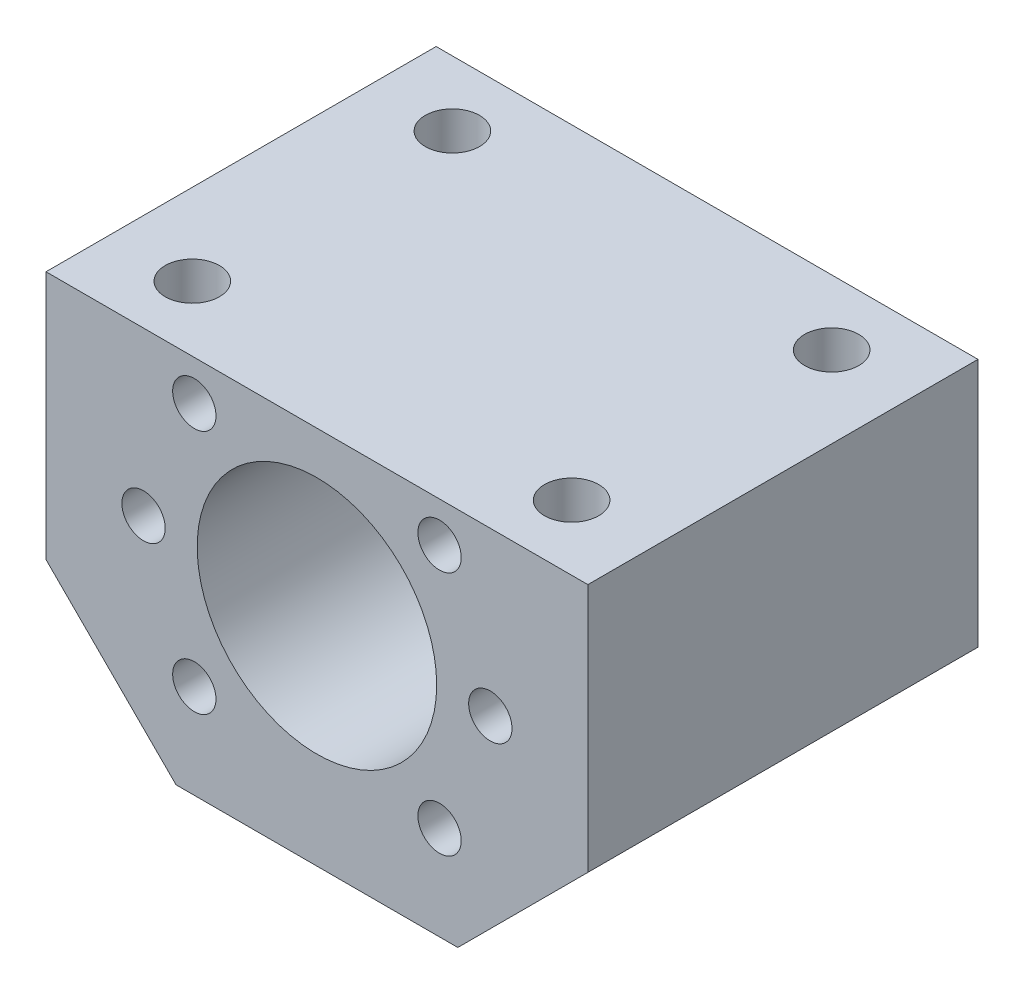
ISO-10303-21;
HEADER;
FILE_DESCRIPTION(('STEP AP214'),'2;1');
FILE_NAME('part.step','',(''),(''),'','','');
FILE_SCHEMA(('AUTOMOTIVE_DESIGN { 1 0 10303 214 1 1 1 1 }'));
ENDSEC;
DATA;
#1=APPLICATION_CONTEXT('core data for automotive mechanical design processes');
#2=APPLICATION_PROTOCOL_DEFINITION('international standard','automotive_design',2000,#1);
#3=PRODUCT_CONTEXT('',#1,'mechanical');
#4=PRODUCT('Part','Part','',(#3));
#5=PRODUCT_RELATED_PRODUCT_CATEGORY('part','',(#4));
#6=PRODUCT_DEFINITION_FORMATION('','',#4);
#7=PRODUCT_DEFINITION_CONTEXT('part definition',#1,'design');
#8=PRODUCT_DEFINITION('design','',#6,#7);
#9=PRODUCT_DEFINITION_SHAPE('','',#8);
#10=(LENGTH_UNIT() NAMED_UNIT(*) SI_UNIT(.MILLI.,.METRE.));
#11=(NAMED_UNIT(*) PLANE_ANGLE_UNIT() SI_UNIT($,.RADIAN.));
#12=(NAMED_UNIT(*) SI_UNIT($,.STERADIAN.) SOLID_ANGLE_UNIT());
#13=UNCERTAINTY_MEASURE_WITH_UNIT(LENGTH_MEASURE(1.E-05),#10,'distance_accuracy_value','');
#14=(GEOMETRIC_REPRESENTATION_CONTEXT(3) GLOBAL_UNCERTAINTY_ASSIGNED_CONTEXT((#13)) GLOBAL_UNIT_ASSIGNED_CONTEXT((#10,
#11,#12)) REPRESENTATION_CONTEXT('',''));
#15=CARTESIAN_POINT('',(0.,0.,0.));
#16=DIRECTION('',(0.,0.,1.));
#17=DIRECTION('',(1.,0.,0.));
#18=AXIS2_PLACEMENT_3D('',#15,#16,#17);
#19=CARTESIAN_POINT('',(0.,0.,36.));
#20=DIRECTION('',(0.,0.,1.));
#21=DIRECTION('',(1.,0.,0.));
#22=AXIS2_PLACEMENT_3D('',#19,#20,#21);
#23=PLANE('',#22);
#24=CARTESIAN_POINT('',(11.3137084989847,11.3137084989848,36.));
#25=DIRECTION('',(0.,0.,1.));
#26=DIRECTION('',(-1.,0.,0.));
#27=AXIS2_PLACEMENT_3D('',#24,#25,#26);
#28=CIRCLE('',#27,2.);
#29=CARTESIAN_POINT('',(9.31370849898474,11.3137084989848,36.));
#30=VERTEX_POINT('',#29);
#31=EDGE_CURVE('E292',#30,#30,#28,.T.);
#32=ORIENTED_EDGE('',*,*,#31,.F.);
#33=EDGE_LOOP('',(#32));
#34=FACE_BOUND('',#33,.T.);
#35=CARTESIAN_POINT('',(-11.3137084989847,-11.3137084989848,36.));
#36=DIRECTION('',(0.,0.,1.));
#37=DIRECTION('',(-1.,0.,0.));
#38=AXIS2_PLACEMENT_3D('',#35,#36,#37);
#39=CIRCLE('',#38,2.);
#40=CARTESIAN_POINT('',(-13.3137084989847,-11.3137084989848,36.));
#41=VERTEX_POINT('',#40);
#42=EDGE_CURVE('E308',#41,#41,#39,.T.);
#43=ORIENTED_EDGE('',*,*,#42,.F.);
#44=EDGE_LOOP('',(#43));
#45=FACE_BOUND('',#44,.T.);
#46=CARTESIAN_POINT('',(-16.,0.,36.));
#47=DIRECTION('',(0.,0.,1.));
#48=DIRECTION('',(1.,0.,0.));
#49=AXIS2_PLACEMENT_3D('',#46,#47,#48);
#50=CIRCLE('',#49,2.);
#51=CARTESIAN_POINT('',(-14.,0.,36.));
#52=VERTEX_POINT('',#51);
#53=EDGE_CURVE('E324',#52,#52,#50,.T.);
#54=ORIENTED_EDGE('',*,*,#53,.F.);
#55=EDGE_LOOP('',(#54));
#56=FACE_BOUND('',#55,.T.);
#57=DIRECTION('',(0.,-1.,0.));
#58=VECTOR('',#57,1.);
#59=CARTESIAN_POINT('',(-25.,15.,36.));
#60=LINE('',#59,#58);
#61=CARTESIAN_POINT('',(-25.,15.,36.));
#62=VERTEX_POINT('',#61);
#63=CARTESIAN_POINT('',(-25.,-8.00000000000001,36.));
#64=VERTEX_POINT('',#63);
#65=EDGE_CURVE('E148',#62,#64,#60,.T.);
#66=ORIENTED_EDGE('',*,*,#65,.T.);
#67=DIRECTION('',(0.707106781186548,-0.707106781186547,0.));
#68=VECTOR('',#67,1.);
#69=CARTESIAN_POINT('',(-25.,-8.00000000000001,36.));
#70=LINE('',#69,#68);
#71=CARTESIAN_POINT('',(-13.,-20.,36.));
#72=VERTEX_POINT('',#71);
#73=EDGE_CURVE('E95',#64,#72,#70,.T.);
#74=ORIENTED_EDGE('',*,*,#73,.T.);
#75=DIRECTION('',(1.,0.,0.));
#76=VECTOR('',#75,1.);
#77=CARTESIAN_POINT('',(-13.,-20.,36.));
#78=LINE('',#77,#76);
#79=CARTESIAN_POINT('',(13.,-20.,36.));
#80=VERTEX_POINT('',#79);
#81=EDGE_CURVE('E108',#72,#80,#78,.T.);
#82=ORIENTED_EDGE('',*,*,#81,.T.);
#83=DIRECTION('',(0.707106781186547,0.707106781186548,0.));
#84=VECTOR('',#83,1.);
#85=CARTESIAN_POINT('',(25.,-8.,36.));
#86=LINE('',#85,#84);
#87=CARTESIAN_POINT('',(25.,-8.,36.));
#88=VERTEX_POINT('',#87);
#89=EDGE_CURVE('E102',#80,#88,#86,.T.);
#90=ORIENTED_EDGE('',*,*,#89,.T.);
#91=DIRECTION('',(0.,1.,0.));
#92=VECTOR('',#91,1.);
#93=CARTESIAN_POINT('',(25.,15.,36.));
#94=LINE('',#93,#92);
#95=CARTESIAN_POINT('',(25.,15.,36.));
#96=VERTEX_POINT('',#95);
#97=EDGE_CURVE('E106',#88,#96,#94,.T.);
#98=ORIENTED_EDGE('',*,*,#97,.T.);
#99=DIRECTION('',(-1.,0.,0.));
#100=VECTOR('',#99,1.);
#101=CARTESIAN_POINT('',(25.,15.,36.));
#102=LINE('',#101,#100);
#103=EDGE_CURVE('E58',#96,#62,#102,.T.);
#104=ORIENTED_EDGE('',*,*,#103,.T.);
#105=EDGE_LOOP('',(#66,#74,#82,#90,#98,#104));
#106=FACE_BOUND('',#105,.T.);
#107=CARTESIAN_POINT('',(0.,0.,36.));
#108=DIRECTION('',(0.,0.,1.));
#109=DIRECTION('',(1.,0.,0.));
#110=AXIS2_PLACEMENT_3D('',#107,#108,#109);
#111=CIRCLE('',#110,11.05);
#112=CARTESIAN_POINT('',(11.05,0.,36.));
#113=VERTEX_POINT('',#112);
#114=EDGE_CURVE('E136',#113,#113,#111,.T.);
#115=ORIENTED_EDGE('',*,*,#114,.F.);
#116=EDGE_LOOP('',(#115));
#117=FACE_BOUND('',#116,.T.);
#118=CARTESIAN_POINT('',(-11.3137084989847,11.3137084989848,36.));
#119=DIRECTION('',(0.,0.,1.));
#120=DIRECTION('',(1.,0.,0.));
#121=AXIS2_PLACEMENT_3D('',#118,#119,#120);
#122=CIRCLE('',#121,2.);
#123=CARTESIAN_POINT('',(-9.31370849898474,11.3137084989848,36.));
#124=VERTEX_POINT('',#123);
#125=EDGE_CURVE('E316',#124,#124,#122,.T.);
#126=ORIENTED_EDGE('',*,*,#125,.F.);
#127=EDGE_LOOP('',(#126));
#128=FACE_BOUND('',#127,.T.);
#129=CARTESIAN_POINT('',(11.3137084989847,-11.3137084989848,36.));
#130=DIRECTION('',(0.,0.,1.));
#131=DIRECTION('',(1.,0.,0.));
#132=AXIS2_PLACEMENT_3D('',#129,#130,#131);
#133=CIRCLE('',#132,2.);
#134=CARTESIAN_POINT('',(13.3137084989847,-11.3137084989848,36.));
#135=VERTEX_POINT('',#134);
#136=EDGE_CURVE('E300',#135,#135,#133,.T.);
#137=ORIENTED_EDGE('',*,*,#136,.F.);
#138=EDGE_LOOP('',(#137));
#139=FACE_BOUND('',#138,.T.);
#140=CARTESIAN_POINT('',(16.,0.,36.));
#141=DIRECTION('',(0.,0.,1.));
#142=DIRECTION('',(-1.,0.,0.));
#143=AXIS2_PLACEMENT_3D('',#140,#141,#142);
#144=CIRCLE('',#143,2.);
#145=CARTESIAN_POINT('',(14.,0.,36.));
#146=VERTEX_POINT('',#145);
#147=EDGE_CURVE('E284',#146,#146,#144,.T.);
#148=ORIENTED_EDGE('',*,*,#147,.F.);
#149=EDGE_LOOP('',(#148));
#150=FACE_BOUND('',#149,.T.);
#151=ADVANCED_FACE('F40',(#34,#45,#56,#106,#117,#128,#139,#150),#23,.T.);
#152=CARTESIAN_POINT('',(0.,0.,0.));
#153=DIRECTION('',(0.,0.,1.));
#154=DIRECTION('',(1.,0.,0.));
#155=AXIS2_PLACEMENT_3D('',#152,#153,#154);
#156=PLANE('',#155);
#157=DIRECTION('',(0.,-1.,0.));
#158=VECTOR('',#157,1.);
#159=CARTESIAN_POINT('',(-25.,15.,0.));
#160=LINE('',#159,#158);
#161=CARTESIAN_POINT('',(-25.,15.,0.));
#162=VERTEX_POINT('',#161);
#163=CARTESIAN_POINT('',(-25.,-8.00000000000001,0.));
#164=VERTEX_POINT('',#163);
#165=EDGE_CURVE('E131',#162,#164,#160,.T.);
#166=ORIENTED_EDGE('',*,*,#165,.F.);
#167=DIRECTION('',(-1.,0.,0.));
#168=VECTOR('',#167,1.);
#169=CARTESIAN_POINT('',(25.,15.,0.));
#170=LINE('',#169,#168);
#171=CARTESIAN_POINT('',(25.,15.,0.));
#172=VERTEX_POINT('',#171);
#173=EDGE_CURVE('E87',#172,#162,#170,.T.);
#174=ORIENTED_EDGE('',*,*,#173,.F.);
#175=DIRECTION('',(0.,1.,0.));
#176=VECTOR('',#175,1.);
#177=CARTESIAN_POINT('',(25.,15.,0.));
#178=LINE('',#177,#176);
#179=CARTESIAN_POINT('',(25.,-8.,0.));
#180=VERTEX_POINT('',#179);
#181=EDGE_CURVE('E81',#180,#172,#178,.T.);
#182=ORIENTED_EDGE('',*,*,#181,.F.);
#183=DIRECTION('',(0.707106781186547,0.707106781186548,0.));
#184=VECTOR('',#183,1.);
#185=CARTESIAN_POINT('',(25.,-8.,0.));
#186=LINE('',#185,#184);
#187=CARTESIAN_POINT('',(13.,-20.,0.));
#188=VERTEX_POINT('',#187);
#189=EDGE_CURVE('E117',#188,#180,#186,.T.);
#190=ORIENTED_EDGE('',*,*,#189,.F.);
#191=DIRECTION('',(1.,0.,0.));
#192=VECTOR('',#191,1.);
#193=CARTESIAN_POINT('',(-13.,-20.,0.));
#194=LINE('',#193,#192);
#195=CARTESIAN_POINT('',(-13.,-20.,0.));
#196=VERTEX_POINT('',#195);
#197=EDGE_CURVE('E139',#196,#188,#194,.T.);
#198=ORIENTED_EDGE('',*,*,#197,.F.);
#199=DIRECTION('',(0.707106781186548,-0.707106781186547,0.));
#200=VECTOR('',#199,1.);
#201=CARTESIAN_POINT('',(-25.,-8.00000000000001,0.));
#202=LINE('',#201,#200);
#203=EDGE_CURVE('E135',#164,#196,#202,.T.);
#204=ORIENTED_EDGE('',*,*,#203,.F.);
#205=EDGE_LOOP('',(#166,#174,#182,#190,#198,#204));
#206=FACE_BOUND('',#205,.T.);
#207=CARTESIAN_POINT('',(0.,0.,0.));
#208=DIRECTION('',(0.,0.,1.));
#209=DIRECTION('',(1.,0.,0.));
#210=AXIS2_PLACEMENT_3D('',#207,#208,#209);
#211=CIRCLE('',#210,11.05);
#212=CARTESIAN_POINT('',(11.05,0.,0.));
#213=VERTEX_POINT('',#212);
#214=EDGE_CURVE('E328',#213,#213,#211,.T.);
#215=ORIENTED_EDGE('',*,*,#214,.T.);
#216=EDGE_LOOP('',(#215));
#217=FACE_BOUND('',#216,.T.);
#218=CARTESIAN_POINT('',(-16.,0.,0.));
#219=DIRECTION('',(0.,0.,1.));
#220=DIRECTION('',(1.,0.,0.));
#221=AXIS2_PLACEMENT_3D('',#218,#219,#220);
#222=CIRCLE('',#221,2.);
#223=CARTESIAN_POINT('',(-14.,0.,0.));
#224=VERTEX_POINT('',#223);
#225=EDGE_CURVE('E320',#224,#224,#222,.T.);
#226=ORIENTED_EDGE('',*,*,#225,.T.);
#227=EDGE_LOOP('',(#226));
#228=FACE_BOUND('',#227,.T.);
#229=CARTESIAN_POINT('',(-11.3137084989847,11.3137084989848,0.));
#230=DIRECTION('',(0.,0.,1.));
#231=DIRECTION('',(1.,0.,0.));
#232=AXIS2_PLACEMENT_3D('',#229,#230,#231);
#233=CIRCLE('',#232,2.);
#234=CARTESIAN_POINT('',(-9.31370849898474,11.3137084989848,0.));
#235=VERTEX_POINT('',#234);
#236=EDGE_CURVE('E312',#235,#235,#233,.T.);
#237=ORIENTED_EDGE('',*,*,#236,.T.);
#238=EDGE_LOOP('',(#237));
#239=FACE_BOUND('',#238,.T.);
#240=CARTESIAN_POINT('',(-11.3137084989847,-11.3137084989848,0.));
#241=DIRECTION('',(0.,0.,1.));
#242=DIRECTION('',(-1.,0.,0.));
#243=AXIS2_PLACEMENT_3D('',#240,#241,#242);
#244=CIRCLE('',#243,2.);
#245=CARTESIAN_POINT('',(-13.3137084989847,-11.3137084989848,0.));
#246=VERTEX_POINT('',#245);
#247=EDGE_CURVE('E304',#246,#246,#244,.T.);
#248=ORIENTED_EDGE('',*,*,#247,.T.);
#249=EDGE_LOOP('',(#248));
#250=FACE_BOUND('',#249,.T.);
#251=CARTESIAN_POINT('',(11.3137084989847,-11.3137084989848,0.));
#252=DIRECTION('',(0.,0.,1.));
#253=DIRECTION('',(1.,0.,0.));
#254=AXIS2_PLACEMENT_3D('',#251,#252,#253);
#255=CIRCLE('',#254,2.);
#256=CARTESIAN_POINT('',(13.3137084989847,-11.3137084989848,0.));
#257=VERTEX_POINT('',#256);
#258=EDGE_CURVE('E296',#257,#257,#255,.T.);
#259=ORIENTED_EDGE('',*,*,#258,.T.);
#260=EDGE_LOOP('',(#259));
#261=FACE_BOUND('',#260,.T.);
#262=CARTESIAN_POINT('',(11.3137084989847,11.3137084989848,0.));
#263=DIRECTION('',(0.,0.,1.));
#264=DIRECTION('',(-1.,0.,0.));
#265=AXIS2_PLACEMENT_3D('',#262,#263,#264);
#266=CIRCLE('',#265,2.);
#267=CARTESIAN_POINT('',(9.31370849898474,11.3137084989848,0.));
#268=VERTEX_POINT('',#267);
#269=EDGE_CURVE('E288',#268,#268,#266,.T.);
#270=ORIENTED_EDGE('',*,*,#269,.T.);
#271=EDGE_LOOP('',(#270));
#272=FACE_BOUND('',#271,.T.);
#273=CARTESIAN_POINT('',(16.,0.,0.));
#274=DIRECTION('',(0.,0.,1.));
#275=DIRECTION('',(-1.,0.,0.));
#276=AXIS2_PLACEMENT_3D('',#273,#274,#275);
#277=CIRCLE('',#276,2.);
#278=CARTESIAN_POINT('',(14.,0.,0.));
#279=VERTEX_POINT('',#278);
#280=EDGE_CURVE('E282',#279,#279,#277,.T.);
#281=ORIENTED_EDGE('',*,*,#280,.T.);
#282=EDGE_LOOP('',(#281));
#283=FACE_BOUND('',#282,.T.);
#284=ADVANCED_FACE('F162',(#206,#217,#228,#239,#250,#261,#272,#283),#156,.F.);
#285=CARTESIAN_POINT('',(-25.,15.,36.));
#286=DIRECTION('',(1.,0.,0.));
#287=DIRECTION('',(0.,1.,0.));
#288=AXIS2_PLACEMENT_3D('',#285,#286,#287);
#289=PLANE('',#288);
#290=ORIENTED_EDGE('',*,*,#165,.T.);
#291=DIRECTION('',(0.,0.,-1.));
#292=VECTOR('',#291,1.);
#293=CARTESIAN_POINT('',(-25.,-8.00000000000001,36.));
#294=LINE('',#293,#292);
#295=EDGE_CURVE('E11',#64,#164,#294,.T.);
#296=ORIENTED_EDGE('',*,*,#295,.F.);
#297=ORIENTED_EDGE('',*,*,#65,.F.);
#298=DIRECTION('',(0.,0.,-1.));
#299=VECTOR('',#298,1.);
#300=CARTESIAN_POINT('',(-25.,15.,36.));
#301=LINE('',#300,#299);
#302=EDGE_CURVE('E127',#62,#162,#301,.T.);
#303=ORIENTED_EDGE('',*,*,#302,.T.);
#304=EDGE_LOOP('',(#290,#296,#297,#303));
#305=FACE_BOUND('',#304,.T.);
#306=ADVANCED_FACE('F42',(#305),#289,.F.);
#307=CARTESIAN_POINT('',(-25.,-8.00000000000001,36.));
#308=DIRECTION('',(0.707106781186547,0.707106781186548,0.));
#309=DIRECTION('',(-0.707106781186548,0.707106781186547,0.));
#310=AXIS2_PLACEMENT_3D('',#307,#308,#309);
#311=PLANE('',#310);
#312=ORIENTED_EDGE('',*,*,#203,.T.);
#313=DIRECTION('',(0.,0.,-1.));
#314=VECTOR('',#313,1.);
#315=CARTESIAN_POINT('',(-13.,-20.,36.));
#316=LINE('',#315,#314);
#317=EDGE_CURVE('E50',#72,#196,#316,.T.);
#318=ORIENTED_EDGE('',*,*,#317,.F.);
#319=ORIENTED_EDGE('',*,*,#73,.F.);
#320=ORIENTED_EDGE('',*,*,#295,.T.);
#321=EDGE_LOOP('',(#312,#318,#319,#320));
#322=FACE_BOUND('',#321,.T.);
#323=ADVANCED_FACE('F552',(#322),#311,.F.);
#324=CARTESIAN_POINT('',(-13.,-20.,36.));
#325=DIRECTION('',(0.,1.,0.));
#326=DIRECTION('',(-1.,0.,0.));
#327=AXIS2_PLACEMENT_3D('',#324,#325,#326);
#328=PLANE('',#327);
#329=ORIENTED_EDGE('',*,*,#197,.T.);
#330=DIRECTION('',(0.,0.,-1.));
#331=VECTOR('',#330,1.);
#332=CARTESIAN_POINT('',(13.,-20.,36.));
#333=LINE('',#332,#331);
#334=EDGE_CURVE('E119',#80,#188,#333,.T.);
#335=ORIENTED_EDGE('',*,*,#334,.F.);
#336=ORIENTED_EDGE('',*,*,#81,.F.);
#337=ORIENTED_EDGE('',*,*,#317,.T.);
#338=EDGE_LOOP('',(#329,#335,#336,#337));
#339=FACE_BOUND('',#338,.T.);
#340=ADVANCED_FACE('F159',(#339),#328,.F.);
#341=CARTESIAN_POINT('',(25.,-8.,36.));
#342=DIRECTION('',(-0.707106781186548,0.707106781186547,0.));
#343=DIRECTION('',(-0.707106781186547,-0.707106781186548,0.));
#344=AXIS2_PLACEMENT_3D('',#341,#342,#343);
#345=PLANE('',#344);
#346=ORIENTED_EDGE('',*,*,#189,.T.);
#347=DIRECTION('',(0.,0.,-1.));
#348=VECTOR('',#347,1.);
#349=CARTESIAN_POINT('',(25.,-8.,36.));
#350=LINE('',#349,#348);
#351=EDGE_CURVE('E114',#88,#180,#350,.T.);
#352=ORIENTED_EDGE('',*,*,#351,.F.);
#353=ORIENTED_EDGE('',*,*,#89,.F.);
#354=ORIENTED_EDGE('',*,*,#334,.T.);
#355=EDGE_LOOP('',(#346,#352,#353,#354));
#356=FACE_BOUND('',#355,.T.);
#357=ADVANCED_FACE('F115',(#356),#345,.F.);
#358=CARTESIAN_POINT('',(25.,15.,36.));
#359=DIRECTION('',(-1.,0.,0.));
#360=DIRECTION('',(0.,-1.,0.));
#361=AXIS2_PLACEMENT_3D('',#358,#359,#360);
#362=PLANE('',#361);
#363=ORIENTED_EDGE('',*,*,#181,.T.);
#364=DIRECTION('',(0.,0.,-1.));
#365=VECTOR('',#364,1.);
#366=CARTESIAN_POINT('',(25.,15.,36.));
#367=LINE('',#366,#365);
#368=EDGE_CURVE('E120',#96,#172,#367,.T.);
#369=ORIENTED_EDGE('',*,*,#368,.F.);
#370=ORIENTED_EDGE('',*,*,#97,.F.);
#371=ORIENTED_EDGE('',*,*,#351,.T.);
#372=EDGE_LOOP('',(#363,#369,#370,#371));
#373=FACE_BOUND('',#372,.T.);
#374=ADVANCED_FACE('F122',(#373),#362,.F.);
#375=CARTESIAN_POINT('',(25.,15.,36.));
#376=DIRECTION('',(0.,-1.,0.));
#377=DIRECTION('',(1.,0.,0.));
#378=AXIS2_PLACEMENT_3D('',#375,#376,#377);
#379=PLANE('',#378);
#380=CARTESIAN_POINT('',(17.5,15.,6.));
#381=DIRECTION('',(0.,1.,0.));
#382=DIRECTION('',(1.,0.,0.));
#383=AXIS2_PLACEMENT_3D('',#380,#381,#382);
#384=CIRCLE('',#383,2.5);
#385=CARTESIAN_POINT('',(20.,15.,6.));
#386=VERTEX_POINT('',#385);
#387=EDGE_CURVE('E276',#386,#386,#384,.T.);
#388=ORIENTED_EDGE('',*,*,#387,.F.);
#389=EDGE_LOOP('',(#388));
#390=FACE_BOUND('',#389,.T.);
#391=CARTESIAN_POINT('',(17.5,15.,30.));
#392=DIRECTION('',(0.,1.,0.));
#393=DIRECTION('',(1.,0.,0.));
#394=AXIS2_PLACEMENT_3D('',#391,#392,#393);
#395=CIRCLE('',#394,2.5);
#396=CARTESIAN_POINT('',(20.,15.,30.));
#397=VERTEX_POINT('',#396);
#398=EDGE_CURVE('E268',#397,#397,#395,.T.);
#399=ORIENTED_EDGE('',*,*,#398,.F.);
#400=EDGE_LOOP('',(#399));
#401=FACE_BOUND('',#400,.T.);
#402=CARTESIAN_POINT('',(-17.5,15.,30.));
#403=DIRECTION('',(0.,1.,0.));
#404=DIRECTION('',(-1.,0.,0.));
#405=AXIS2_PLACEMENT_3D('',#402,#403,#404);
#406=CIRCLE('',#405,2.5);
#407=CARTESIAN_POINT('',(-20.,15.,30.));
#408=VERTEX_POINT('',#407);
#409=EDGE_CURVE('E253',#408,#408,#406,.T.);
#410=ORIENTED_EDGE('',*,*,#409,.F.);
#411=EDGE_LOOP('',(#410));
#412=FACE_BOUND('',#411,.T.);
#413=CARTESIAN_POINT('',(-17.5,15.,6.00000000000001));
#414=DIRECTION('',(0.,1.,0.));
#415=DIRECTION('',(-1.,0.,0.));
#416=AXIS2_PLACEMENT_3D('',#413,#414,#415);
#417=CIRCLE('',#416,2.5);
#418=CARTESIAN_POINT('',(-20.,15.,6.00000000000001));
#419=VERTEX_POINT('',#418);
#420=EDGE_CURVE('E252',#419,#419,#417,.T.);
#421=ORIENTED_EDGE('',*,*,#420,.F.);
#422=EDGE_LOOP('',(#421));
#423=FACE_BOUND('',#422,.T.);
#424=ORIENTED_EDGE('',*,*,#173,.T.);
#425=ORIENTED_EDGE('',*,*,#302,.F.);
#426=ORIENTED_EDGE('',*,*,#103,.F.);
#427=ORIENTED_EDGE('',*,*,#368,.T.);
#428=EDGE_LOOP('',(#424,#425,#426,#427));
#429=FACE_BOUND('',#428,.T.);
#430=ADVANCED_FACE('F167',(#390,#401,#412,#423,#429),#379,.F.);
#431=CARTESIAN_POINT('',(0.,0.,36.));
#432=DIRECTION('',(0.,0.,-1.));
#433=DIRECTION('',(-1.,0.,0.));
#434=AXIS2_PLACEMENT_3D('',#431,#432,#433);
#435=CYLINDRICAL_SURFACE('',#434,11.05);
#436=ORIENTED_EDGE('',*,*,#114,.T.);
#437=EDGE_LOOP('',(#436));
#438=FACE_BOUND('',#437,.T.);
#439=ORIENTED_EDGE('',*,*,#214,.F.);
#440=EDGE_LOOP('',(#439));
#441=FACE_BOUND('',#440,.T.);
#442=ADVANCED_FACE('F169',(#438,#441),#435,.F.);
#443=CARTESIAN_POINT('',(-16.,0.,36.));
#444=DIRECTION('',(0.,0.,-1.));
#445=DIRECTION('',(-1.,0.,0.));
#446=AXIS2_PLACEMENT_3D('',#443,#444,#445);
#447=CYLINDRICAL_SURFACE('',#446,2.);
#448=ORIENTED_EDGE('',*,*,#53,.T.);
#449=EDGE_LOOP('',(#448));
#450=FACE_BOUND('',#449,.T.);
#451=ORIENTED_EDGE('',*,*,#225,.F.);
#452=EDGE_LOOP('',(#451));
#453=FACE_BOUND('',#452,.T.);
#454=ADVANCED_FACE('F176',(#450,#453),#447,.F.);
#455=CARTESIAN_POINT('',(-11.3137084989847,11.3137084989848,36.));
#456=DIRECTION('',(0.,0.,-1.));
#457=DIRECTION('',(-1.,0.,0.));
#458=AXIS2_PLACEMENT_3D('',#455,#456,#457);
#459=CYLINDRICAL_SURFACE('',#458,2.);
#460=ORIENTED_EDGE('',*,*,#125,.T.);
#461=EDGE_LOOP('',(#460));
#462=FACE_BOUND('',#461,.T.);
#463=ORIENTED_EDGE('',*,*,#236,.F.);
#464=EDGE_LOOP('',(#463));
#465=FACE_BOUND('',#464,.T.);
#466=ADVANCED_FACE('F194',(#462,#465),#459,.F.);
#467=CARTESIAN_POINT('',(-11.3137084989847,-11.3137084989848,36.));
#468=DIRECTION('',(0.,0.,-1.));
#469=DIRECTION('',(-1.,0.,0.));
#470=AXIS2_PLACEMENT_3D('',#467,#468,#469);
#471=CYLINDRICAL_SURFACE('',#470,2.);
#472=ORIENTED_EDGE('',*,*,#42,.T.);
#473=EDGE_LOOP('',(#472));
#474=FACE_BOUND('',#473,.T.);
#475=ORIENTED_EDGE('',*,*,#247,.F.);
#476=EDGE_LOOP('',(#475));
#477=FACE_BOUND('',#476,.T.);
#478=ADVANCED_FACE('F198',(#474,#477),#471,.F.);
#479=CARTESIAN_POINT('',(11.3137084989847,-11.3137084989848,36.));
#480=DIRECTION('',(0.,0.,-1.));
#481=DIRECTION('',(-1.,0.,0.));
#482=AXIS2_PLACEMENT_3D('',#479,#480,#481);
#483=CYLINDRICAL_SURFACE('',#482,2.);
#484=ORIENTED_EDGE('',*,*,#136,.T.);
#485=EDGE_LOOP('',(#484));
#486=FACE_BOUND('',#485,.T.);
#487=ORIENTED_EDGE('',*,*,#258,.F.);
#488=EDGE_LOOP('',(#487));
#489=FACE_BOUND('',#488,.T.);
#490=ADVANCED_FACE('F202',(#486,#489),#483,.F.);
#491=CARTESIAN_POINT('',(11.3137084989847,11.3137084989848,36.));
#492=DIRECTION('',(0.,0.,-1.));
#493=DIRECTION('',(-1.,0.,0.));
#494=AXIS2_PLACEMENT_3D('',#491,#492,#493);
#495=CYLINDRICAL_SURFACE('',#494,2.);
#496=ORIENTED_EDGE('',*,*,#31,.T.);
#497=EDGE_LOOP('',(#496));
#498=FACE_BOUND('',#497,.T.);
#499=ORIENTED_EDGE('',*,*,#269,.F.);
#500=EDGE_LOOP('',(#499));
#501=FACE_BOUND('',#500,.T.);
#502=ADVANCED_FACE('F206',(#498,#501),#495,.F.);
#503=CARTESIAN_POINT('',(16.,0.,36.));
#504=DIRECTION('',(0.,0.,-1.));
#505=DIRECTION('',(-1.,0.,0.));
#506=AXIS2_PLACEMENT_3D('',#503,#504,#505);
#507=CYLINDRICAL_SURFACE('',#506,2.);
#508=ORIENTED_EDGE('',*,*,#147,.T.);
#509=EDGE_LOOP('',(#508));
#510=FACE_BOUND('',#509,.T.);
#511=ORIENTED_EDGE('',*,*,#280,.F.);
#512=EDGE_LOOP('',(#511));
#513=FACE_BOUND('',#512,.T.);
#514=ADVANCED_FACE('F210',(#510,#513),#507,.F.);
#515=CARTESIAN_POINT('',(-17.5,5.,6.00000000000001));
#516=DIRECTION('',(0.,1.,0.));
#517=DIRECTION('',(-1.,0.,0.));
#518=AXIS2_PLACEMENT_3D('',#515,#516,#517);
#519=CYLINDRICAL_SURFACE('',#518,2.5);
#520=CARTESIAN_POINT('',(-17.5,5.,6.00000000000001));
#521=DIRECTION('',(0.,1.,0.));
#522=DIRECTION('',(-1.,0.,0.));
#523=AXIS2_PLACEMENT_3D('',#520,#521,#522);
#524=CIRCLE('',#523,2.5);
#525=CARTESIAN_POINT('',(-20.,5.,6.00000000000001));
#526=VERTEX_POINT('',#525);
#527=EDGE_CURVE('E259',#526,#526,#524,.T.);
#528=ORIENTED_EDGE('',*,*,#527,.F.);
#529=EDGE_LOOP('',(#528));
#530=FACE_BOUND('',#529,.T.);
#531=ORIENTED_EDGE('',*,*,#420,.T.);
#532=EDGE_LOOP('',(#531));
#533=FACE_BOUND('',#532,.T.);
#534=ADVANCED_FACE('F214',(#530,#533),#519,.F.);
#535=CARTESIAN_POINT('',(-17.5,5.,6.00000000000001));
#536=DIRECTION('',(0.,1.,0.));
#537=DIRECTION('',(-1.,0.,0.));
#538=AXIS2_PLACEMENT_3D('',#535,#536,#537);
#539=PLANE('',#538);
#540=ORIENTED_EDGE('',*,*,#527,.T.);
#541=EDGE_LOOP('',(#540));
#542=FACE_BOUND('',#541,.T.);
#543=ADVANCED_FACE('F218',(#542),#539,.T.);
#544=CARTESIAN_POINT('',(-17.5,5.,30.));
#545=DIRECTION('',(0.,1.,0.));
#546=DIRECTION('',(-1.,0.,0.));
#547=AXIS2_PLACEMENT_3D('',#544,#545,#546);
#548=CYLINDRICAL_SURFACE('',#547,2.5);
#549=CARTESIAN_POINT('',(-17.5,5.,30.));
#550=DIRECTION('',(0.,1.,0.));
#551=DIRECTION('',(-1.,0.,0.));
#552=AXIS2_PLACEMENT_3D('',#549,#550,#551);
#553=CIRCLE('',#552,2.5);
#554=CARTESIAN_POINT('',(-20.,5.,30.));
#555=VERTEX_POINT('',#554);
#556=EDGE_CURVE('E250',#555,#555,#553,.T.);
#557=ORIENTED_EDGE('',*,*,#556,.F.);
#558=EDGE_LOOP('',(#557));
#559=FACE_BOUND('',#558,.T.);
#560=ORIENTED_EDGE('',*,*,#409,.T.);
#561=EDGE_LOOP('',(#560));
#562=FACE_BOUND('',#561,.T.);
#563=ADVANCED_FACE('F222',(#559,#562),#548,.F.);
#564=CARTESIAN_POINT('',(-17.5,5.,30.));
#565=DIRECTION('',(0.,1.,0.));
#566=DIRECTION('',(-1.,0.,0.));
#567=AXIS2_PLACEMENT_3D('',#564,#565,#566);
#568=PLANE('',#567);
#569=ORIENTED_EDGE('',*,*,#556,.T.);
#570=EDGE_LOOP('',(#569));
#571=FACE_BOUND('',#570,.T.);
#572=ADVANCED_FACE('F236',(#571),#568,.T.);
#573=CARTESIAN_POINT('',(17.5,5.,30.));
#574=DIRECTION('',(0.,1.,0.));
#575=DIRECTION('',(-1.,0.,0.));
#576=AXIS2_PLACEMENT_3D('',#573,#574,#575);
#577=CYLINDRICAL_SURFACE('',#576,2.5);
#578=CARTESIAN_POINT('',(17.5,5.,30.));
#579=DIRECTION('',(0.,1.,0.));
#580=DIRECTION('',(1.,0.,0.));
#581=AXIS2_PLACEMENT_3D('',#578,#579,#580);
#582=CIRCLE('',#581,2.5);
#583=CARTESIAN_POINT('',(20.,5.,30.));
#584=VERTEX_POINT('',#583);
#585=EDGE_CURVE('E262',#584,#584,#582,.T.);
#586=ORIENTED_EDGE('',*,*,#585,.F.);
#587=EDGE_LOOP('',(#586));
#588=FACE_BOUND('',#587,.T.);
#589=ORIENTED_EDGE('',*,*,#398,.T.);
#590=EDGE_LOOP('',(#589));
#591=FACE_BOUND('',#590,.T.);
#592=ADVANCED_FACE('F233',(#588,#591),#577,.F.);
#593=CARTESIAN_POINT('',(17.5,5.,30.));
#594=DIRECTION('',(0.,-1.,0.));
#595=DIRECTION('',(1.,0.,0.));
#596=AXIS2_PLACEMENT_3D('',#593,#594,#595);
#597=PLANE('',#596);
#598=ORIENTED_EDGE('',*,*,#585,.T.);
#599=EDGE_LOOP('',(#598));
#600=FACE_BOUND('',#599,.T.);
#601=ADVANCED_FACE('F228',(#600),#597,.F.);
#602=CARTESIAN_POINT('',(17.5,5.,6.));
#603=DIRECTION('',(0.,1.,0.));
#604=DIRECTION('',(-1.,0.,0.));
#605=AXIS2_PLACEMENT_3D('',#602,#603,#604);
#606=CYLINDRICAL_SURFACE('',#605,2.5);
#607=CARTESIAN_POINT('',(17.5,5.,6.));
#608=DIRECTION('',(0.,1.,0.));
#609=DIRECTION('',(1.,0.,0.));
#610=AXIS2_PLACEMENT_3D('',#607,#608,#609);
#611=CIRCLE('',#610,2.5);
#612=CARTESIAN_POINT('',(20.,5.,6.));
#613=VERTEX_POINT('',#612);
#614=EDGE_CURVE('E272',#613,#613,#611,.T.);
#615=ORIENTED_EDGE('',*,*,#614,.F.);
#616=EDGE_LOOP('',(#615));
#617=FACE_BOUND('',#616,.T.);
#618=ORIENTED_EDGE('',*,*,#387,.T.);
#619=EDGE_LOOP('',(#618));
#620=FACE_BOUND('',#619,.T.);
#621=ADVANCED_FACE('F224',(#617,#620),#606,.F.);
#622=CARTESIAN_POINT('',(17.5,5.,6.));
#623=DIRECTION('',(0.,-1.,0.));
#624=DIRECTION('',(1.,0.,0.));
#625=AXIS2_PLACEMENT_3D('',#622,#623,#624);
#626=PLANE('',#625);
#627=ORIENTED_EDGE('',*,*,#614,.T.);
#628=EDGE_LOOP('',(#627));
#629=FACE_BOUND('',#628,.T.);
#630=ADVANCED_FACE('F227',(#629),#626,.F.);
#631=CLOSED_SHELL('',(#151,#284,#306,#323,#340,#357,#374,#430,#442,#454,#466,#478,#490,#502,
#514,#534,#543,#563,#572,#592,#601,#621,#630));
#632=MANIFOLD_SOLID_BREP('B2',#631);
#633=ADVANCED_BREP_SHAPE_REPRESENTATION('',(#18,#632),#14);
#634=SHAPE_DEFINITION_REPRESENTATION(#9,#633);
ENDSEC;
END-ISO-10303-21;
